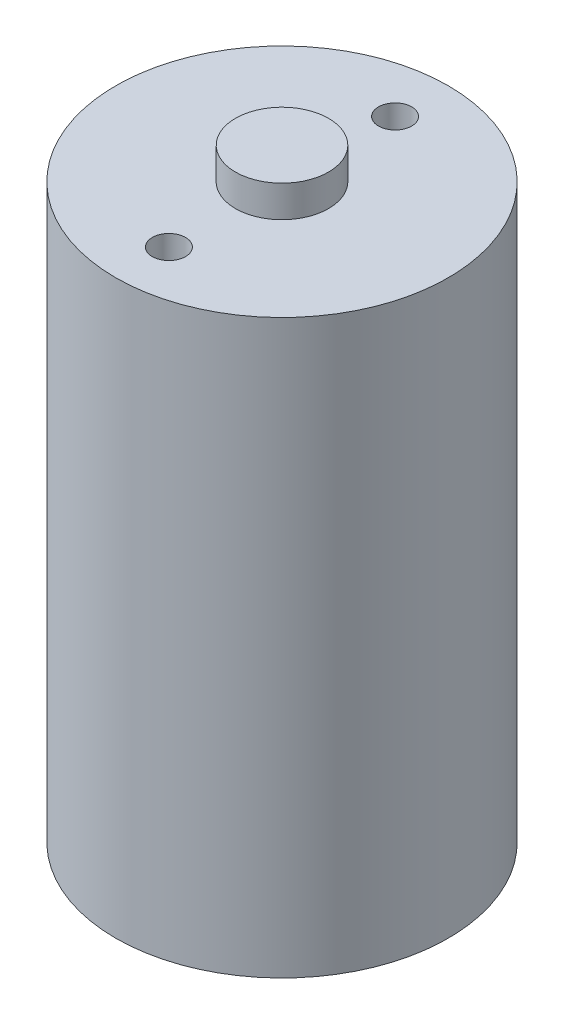
ISO-10303-21;
HEADER;
FILE_DESCRIPTION(('STEP AP214'),'2;1');
FILE_NAME('part.step','',(''),(''),'','','');
FILE_SCHEMA(('AUTOMOTIVE_DESIGN { 1 0 10303 214 1 1 1 1 }'));
ENDSEC;
DATA;
#1=APPLICATION_CONTEXT('core data for automotive mechanical design processes');
#2=APPLICATION_PROTOCOL_DEFINITION('international standard','automotive_design',2000,#1);
#3=PRODUCT_CONTEXT('',#1,'mechanical');
#4=PRODUCT('Part','Part','',(#3));
#5=PRODUCT_RELATED_PRODUCT_CATEGORY('part','',(#4));
#6=PRODUCT_DEFINITION_FORMATION('','',#4);
#7=PRODUCT_DEFINITION_CONTEXT('part definition',#1,'design');
#8=PRODUCT_DEFINITION('design','',#6,#7);
#9=PRODUCT_DEFINITION_SHAPE('','',#8);
#10=(LENGTH_UNIT() NAMED_UNIT(*) SI_UNIT(.MILLI.,.METRE.));
#11=(NAMED_UNIT(*) PLANE_ANGLE_UNIT() SI_UNIT($,.RADIAN.));
#12=(NAMED_UNIT(*) SI_UNIT($,.STERADIAN.) SOLID_ANGLE_UNIT());
#13=UNCERTAINTY_MEASURE_WITH_UNIT(LENGTH_MEASURE(1.E-05),#10,'distance_accuracy_value','');
#14=(GEOMETRIC_REPRESENTATION_CONTEXT(3) GLOBAL_UNCERTAINTY_ASSIGNED_CONTEXT((#13)) GLOBAL_UNIT_ASSIGNED_CONTEXT((#10,
#11,#12)) REPRESENTATION_CONTEXT('',''));
#15=CARTESIAN_POINT('',(0.,0.,0.));
#16=DIRECTION('',(0.,0.,1.));
#17=DIRECTION('',(1.,0.,0.));
#18=AXIS2_PLACEMENT_3D('',#15,#16,#17);
#19=CARTESIAN_POINT('',(0.,43.,0.));
#20=DIRECTION('',(0.,-1.,0.));
#21=DIRECTION('',(0.,0.,-1.));
#22=AXIS2_PLACEMENT_3D('',#19,#20,#21);
#23=CYLINDRICAL_SURFACE('',#22,12.5);
#24=CARTESIAN_POINT('',(0.,43.,0.));
#25=DIRECTION('',(0.,1.,0.));
#26=DIRECTION('',(0.,0.,1.));
#27=AXIS2_PLACEMENT_3D('',#24,#25,#26);
#28=CIRCLE('',#27,12.5);
#29=CARTESIAN_POINT('',(0.,43.,12.5));
#30=VERTEX_POINT('',#29);
#31=EDGE_CURVE('E42',#30,#30,#28,.T.);
#32=ORIENTED_EDGE('',*,*,#31,.F.);
#33=EDGE_LOOP('',(#32));
#34=FACE_BOUND('',#33,.T.);
#35=CARTESIAN_POINT('',(0.,0.,0.));
#36=DIRECTION('',(0.,1.,0.));
#37=DIRECTION('',(0.,0.,1.));
#38=AXIS2_PLACEMENT_3D('',#35,#36,#37);
#39=CIRCLE('',#38,12.5);
#40=CARTESIAN_POINT('',(0.,0.,12.5));
#41=VERTEX_POINT('',#40);
#42=EDGE_CURVE('E38',#41,#41,#39,.T.);
#43=ORIENTED_EDGE('',*,*,#42,.T.);
#44=EDGE_LOOP('',(#43));
#45=FACE_BOUND('',#44,.T.);
#46=ADVANCED_FACE('F35',(#34,#45),#23,.T.);
#47=CARTESIAN_POINT('',(0.,43.,0.));
#48=DIRECTION('',(0.,1.,0.));
#49=DIRECTION('',(0.,0.,1.));
#50=AXIS2_PLACEMENT_3D('',#47,#48,#49);
#51=PLANE('',#50);
#52=CARTESIAN_POINT('',(0.,43.,-8.5));
#53=DIRECTION('',(0.,1.,0.));
#54=DIRECTION('',(0.,0.,1.));
#55=AXIS2_PLACEMENT_3D('',#52,#53,#54);
#56=CIRCLE('',#55,1.25);
#57=CARTESIAN_POINT('',(0.,43.,-7.25));
#58=VERTEX_POINT('',#57);
#59=EDGE_CURVE('E58',#58,#58,#56,.T.);
#60=ORIENTED_EDGE('',*,*,#59,.F.);
#61=EDGE_LOOP('',(#60));
#62=FACE_BOUND('',#61,.T.);
#63=CARTESIAN_POINT('',(0.,43.,8.5));
#64=DIRECTION('',(0.,1.,0.));
#65=DIRECTION('',(0.,0.,1.));
#66=AXIS2_PLACEMENT_3D('',#63,#64,#65);
#67=CIRCLE('',#66,1.25);
#68=CARTESIAN_POINT('',(0.,43.,9.75));
#69=VERTEX_POINT('',#68);
#70=EDGE_CURVE('E52',#69,#69,#67,.T.);
#71=ORIENTED_EDGE('',*,*,#70,.F.);
#72=EDGE_LOOP('',(#71));
#73=FACE_BOUND('',#72,.T.);
#74=CARTESIAN_POINT('',(0.,43.,0.));
#75=DIRECTION('',(0.,1.,0.));
#76=DIRECTION('',(0.,0.,1.));
#77=AXIS2_PLACEMENT_3D('',#74,#75,#76);
#78=CIRCLE('',#77,3.5);
#79=CARTESIAN_POINT('',(0.,43.,3.5));
#80=VERTEX_POINT('',#79);
#81=EDGE_CURVE('E10',#80,#80,#78,.T.);
#82=ORIENTED_EDGE('',*,*,#81,.F.);
#83=EDGE_LOOP('',(#82));
#84=FACE_BOUND('',#83,.T.);
#85=ORIENTED_EDGE('',*,*,#31,.T.);
#86=EDGE_LOOP('',(#85));
#87=FACE_BOUND('',#86,.T.);
#88=ADVANCED_FACE('F73',(#62,#73,#84,#87),#51,.T.);
#89=CARTESIAN_POINT('',(0.,0.,0.));
#90=DIRECTION('',(0.,1.,0.));
#91=DIRECTION('',(0.,0.,1.));
#92=AXIS2_PLACEMENT_3D('',#89,#90,#91);
#93=PLANE('',#92);
#94=ORIENTED_EDGE('',*,*,#42,.F.);
#95=EDGE_LOOP('',(#94));
#96=FACE_BOUND('',#95,.T.);
#97=ADVANCED_FACE('F76',(#96),#93,.F.);
#98=CARTESIAN_POINT('',(0.,45.38,0.));
#99=DIRECTION('',(0.,-1.,0.));
#100=DIRECTION('',(0.,0.,-1.));
#101=AXIS2_PLACEMENT_3D('',#98,#99,#100);
#102=CYLINDRICAL_SURFACE('',#101,3.5);
#103=CARTESIAN_POINT('',(0.,45.38,0.));
#104=DIRECTION('',(0.,1.,0.));
#105=DIRECTION('',(0.,0.,1.));
#106=AXIS2_PLACEMENT_3D('',#103,#104,#105);
#107=CIRCLE('',#106,3.5);
#108=CARTESIAN_POINT('',(0.,45.38,3.5));
#109=VERTEX_POINT('',#108);
#110=EDGE_CURVE('E48',#109,#109,#107,.T.);
#111=ORIENTED_EDGE('',*,*,#110,.F.);
#112=EDGE_LOOP('',(#111));
#113=FACE_BOUND('',#112,.T.);
#114=ORIENTED_EDGE('',*,*,#81,.T.);
#115=EDGE_LOOP('',(#114));
#116=FACE_BOUND('',#115,.T.);
#117=ADVANCED_FACE('F89',(#113,#116),#102,.T.);
#118=CARTESIAN_POINT('',(0.,45.38,0.));
#119=DIRECTION('',(0.,1.,0.));
#120=DIRECTION('',(0.,0.,1.));
#121=AXIS2_PLACEMENT_3D('',#118,#119,#120);
#122=PLANE('',#121);
#123=ORIENTED_EDGE('',*,*,#110,.T.);
#124=EDGE_LOOP('',(#123));
#125=FACE_BOUND('',#124,.T.);
#126=ADVANCED_FACE('F93',(#125),#122,.T.);
#127=CARTESIAN_POINT('',(0.,39.,8.5));
#128=DIRECTION('',(0.,1.,0.));
#129=DIRECTION('',(0.,0.,1.));
#130=AXIS2_PLACEMENT_3D('',#127,#128,#129);
#131=CYLINDRICAL_SURFACE('',#130,1.25);
#132=CARTESIAN_POINT('',(0.,39.,8.5));
#133=DIRECTION('',(0.,1.,0.));
#134=DIRECTION('',(0.,0.,1.));
#135=AXIS2_PLACEMENT_3D('',#132,#133,#134);
#136=CIRCLE('',#135,1.25);
#137=CARTESIAN_POINT('',(0.,39.,9.75));
#138=VERTEX_POINT('',#137);
#139=EDGE_CURVE('E55',#138,#138,#136,.T.);
#140=ORIENTED_EDGE('',*,*,#139,.F.);
#141=EDGE_LOOP('',(#140));
#142=FACE_BOUND('',#141,.T.);
#143=ORIENTED_EDGE('',*,*,#70,.T.);
#144=EDGE_LOOP('',(#143));
#145=FACE_BOUND('',#144,.T.);
#146=ADVANCED_FACE('F99',(#142,#145),#131,.F.);
#147=CARTESIAN_POINT('',(0.,39.,8.5));
#148=DIRECTION('',(0.,1.,0.));
#149=DIRECTION('',(0.,0.,1.));
#150=AXIS2_PLACEMENT_3D('',#147,#148,#149);
#151=PLANE('',#150);
#152=ORIENTED_EDGE('',*,*,#139,.T.);
#153=EDGE_LOOP('',(#152));
#154=FACE_BOUND('',#153,.T.);
#155=ADVANCED_FACE('F69',(#154),#151,.T.);
#156=CARTESIAN_POINT('',(0.,39.,-8.5));
#157=DIRECTION('',(0.,1.,0.));
#158=DIRECTION('',(0.,0.,1.));
#159=AXIS2_PLACEMENT_3D('',#156,#157,#158);
#160=CYLINDRICAL_SURFACE('',#159,1.25);
#161=CARTESIAN_POINT('',(0.,39.,-8.5));
#162=DIRECTION('',(0.,1.,0.));
#163=DIRECTION('',(0.,0.,1.));
#164=AXIS2_PLACEMENT_3D('',#161,#162,#163);
#165=CIRCLE('',#164,1.25);
#166=CARTESIAN_POINT('',(0.,39.,-7.25));
#167=VERTEX_POINT('',#166);
#168=EDGE_CURVE('E51',#167,#167,#165,.T.);
#169=ORIENTED_EDGE('',*,*,#168,.F.);
#170=EDGE_LOOP('',(#169));
#171=FACE_BOUND('',#170,.T.);
#172=ORIENTED_EDGE('',*,*,#59,.T.);
#173=EDGE_LOOP('',(#172));
#174=FACE_BOUND('',#173,.T.);
#175=ADVANCED_FACE('F66',(#171,#174),#160,.F.);
#176=CARTESIAN_POINT('',(0.,39.,-8.5));
#177=DIRECTION('',(0.,1.,0.));
#178=DIRECTION('',(0.,0.,1.));
#179=AXIS2_PLACEMENT_3D('',#176,#177,#178);
#180=PLANE('',#179);
#181=ORIENTED_EDGE('',*,*,#168,.T.);
#182=EDGE_LOOP('',(#181));
#183=FACE_BOUND('',#182,.T.);
#184=ADVANCED_FACE('F64',(#183),#180,.T.);
#185=CLOSED_SHELL('',(#46,#88,#97,#117,#126,#146,#155,#175,#184));
#186=MANIFOLD_SOLID_BREP('B2',#185);
#187=ADVANCED_BREP_SHAPE_REPRESENTATION('',(#18,#186),#14);
#188=SHAPE_DEFINITION_REPRESENTATION(#9,#187);
ENDSEC;
END-ISO-10303-21;
